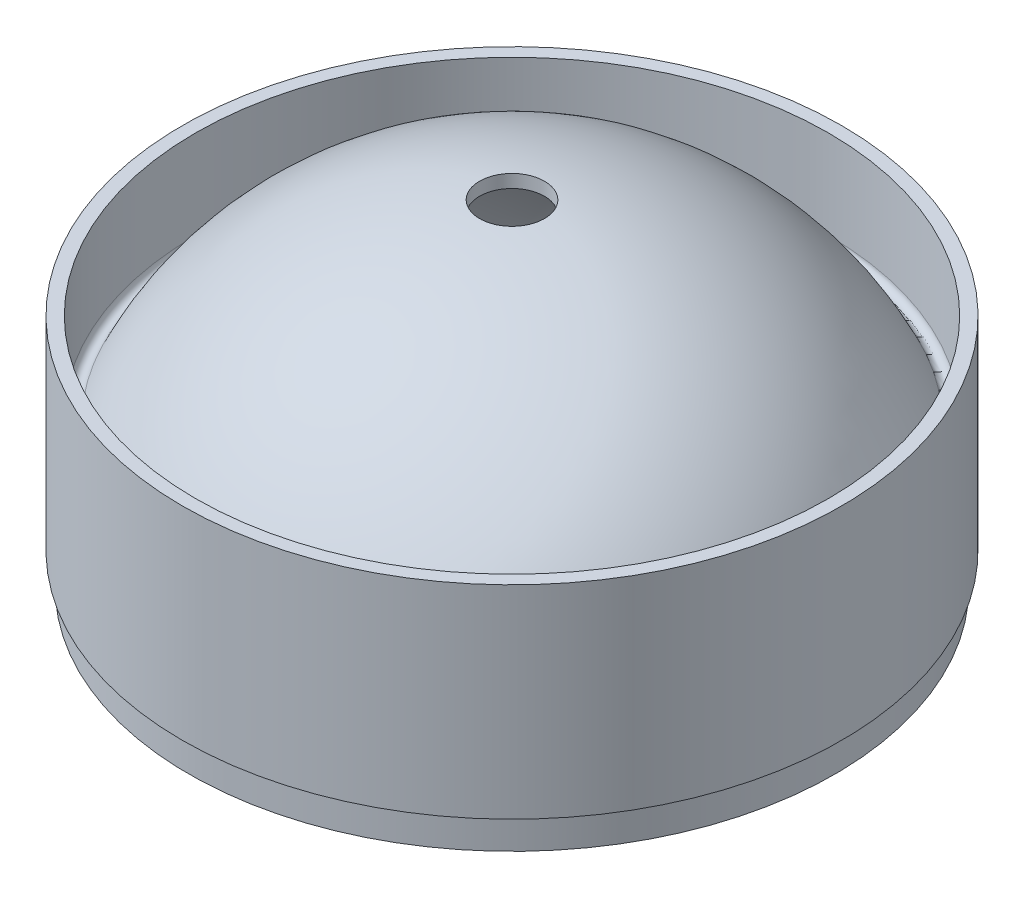
ISO-10303-21;
HEADER;
FILE_DESCRIPTION(('STEP AP214'),'2;1');
FILE_NAME('part.step','',(''),(''),'','','');
FILE_SCHEMA(('AUTOMOTIVE_DESIGN { 1 0 10303 214 1 1 1 1 }'));
ENDSEC;
DATA;
#1=APPLICATION_CONTEXT('core data for automotive mechanical design processes');
#2=APPLICATION_PROTOCOL_DEFINITION('international standard','automotive_design',2000,#1);
#3=PRODUCT_CONTEXT('',#1,'mechanical');
#4=PRODUCT('Part','Part','',(#3));
#5=PRODUCT_RELATED_PRODUCT_CATEGORY('part','',(#4));
#6=PRODUCT_DEFINITION_FORMATION('','',#4);
#7=PRODUCT_DEFINITION_CONTEXT('part definition',#1,'design');
#8=PRODUCT_DEFINITION('design','',#6,#7);
#9=PRODUCT_DEFINITION_SHAPE('','',#8);
#10=(LENGTH_UNIT() NAMED_UNIT(*) SI_UNIT(.MILLI.,.METRE.));
#11=(NAMED_UNIT(*) PLANE_ANGLE_UNIT() SI_UNIT($,.RADIAN.));
#12=(NAMED_UNIT(*) SI_UNIT($,.STERADIAN.) SOLID_ANGLE_UNIT());
#13=UNCERTAINTY_MEASURE_WITH_UNIT(LENGTH_MEASURE(1.E-05),#10,'distance_accuracy_value','');
#14=(GEOMETRIC_REPRESENTATION_CONTEXT(3) GLOBAL_UNCERTAINTY_ASSIGNED_CONTEXT((#13)) GLOBAL_UNIT_ASSIGNED_CONTEXT((#10,
#11,#12)) REPRESENTATION_CONTEXT('',''));
#15=CARTESIAN_POINT('',(0.,0.,0.));
#16=DIRECTION('',(0.,0.,1.));
#17=DIRECTION('',(1.,0.,0.));
#18=AXIS2_PLACEMENT_3D('',#15,#16,#17);
#19=CARTESIAN_POINT('',(0.,875.58,0.));
#20=DIRECTION('',(0.,-1.,0.));
#21=DIRECTION('',(1.,0.,0.));
#22=AXIS2_PLACEMENT_3D('',#19,#20,#21);
#23=SPHERICAL_SURFACE('',#22,124.42);
#24=CARTESIAN_POINT('',(0.,999.370493980758,0.));
#25=DIRECTION('',(0.,-1.,0.));
#26=DIRECTION('',(0.,0.,-1.));
#27=AXIS2_PLACEMENT_3D('',#24,#25,#26);
#28=CIRCLE('',#27,12.5);
#29=CARTESIAN_POINT('',(0.,999.370493980758,-12.5));
#30=VERTEX_POINT('',#29);
#31=EDGE_CURVE('E70',#30,#30,#28,.T.);
#32=ORIENTED_EDGE('',*,*,#31,.F.);
#33=EDGE_LOOP('',(#32));
#34=FACE_BOUND('',#33,.T.);
#35=CARTESIAN_POINT('',(0.,900.,0.));
#36=DIRECTION('',(0.,-1.,0.));
#37=DIRECTION('',(0.,0.,-1.));
#38=AXIS2_PLACEMENT_3D('',#35,#36,#37);
#39=CIRCLE('',#38,122.);
#40=CARTESIAN_POINT('',(0.,900.,-122.));
#41=VERTEX_POINT('',#40);
#42=EDGE_CURVE('E67',#41,#41,#39,.T.);
#43=ORIENTED_EDGE('',*,*,#42,.T.);
#44=EDGE_LOOP('',(#43));
#45=FACE_BOUND('',#44,.T.);
#46=ADVANCED_FACE('F36',(#34,#45),#23,.F.);
#47=CARTESIAN_POINT('',(0.,875.58,0.));
#48=DIRECTION('',(0.,-1.,0.));
#49=DIRECTION('',(1.,0.,0.));
#50=AXIS2_PLACEMENT_3D('',#47,#48,#49);
#51=SPHERICAL_SURFACE('',#50,129.42);
#52=CARTESIAN_POINT('',(0.,1004.39493081161,0.));
#53=DIRECTION('',(0.,-1.,0.));
#54=DIRECTION('',(0.,0.,-1.));
#55=AXIS2_PLACEMENT_3D('',#52,#53,#54);
#56=CIRCLE('',#55,12.5);
#57=CARTESIAN_POINT('',(0.,1004.39493081161,-12.5));
#58=VERTEX_POINT('',#57);
#59=EDGE_CURVE('E39',#58,#58,#56,.F.);
#60=ORIENTED_EDGE('',*,*,#59,.F.);
#61=EDGE_LOOP('',(#60));
#62=FACE_BOUND('',#61,.T.);
#63=CARTESIAN_POINT('',(0.,930.401569107859,0.));
#64=DIRECTION('',(0.,-1.,0.));
#65=DIRECTION('',(0.,0.,-1.));
#66=AXIS2_PLACEMENT_3D('',#63,#64,#65);
#67=CIRCLE('',#66,117.235369921164);
#68=CARTESIAN_POINT('',(0.,930.401569107859,-117.235369921164));
#69=VERTEX_POINT('',#68);
#70=EDGE_CURVE('E10',#69,#69,#67,.T.);
#71=ORIENTED_EDGE('',*,*,#70,.F.);
#72=EDGE_LOOP('',(#71));
#73=FACE_BOUND('',#72,.T.);
#74=ADVANCED_FACE('F79',(#62,#73),#51,.T.);
#75=CARTESIAN_POINT('',(0.,931.460554757447,0.));
#76=DIRECTION('',(0.,-1.,0.));
#77=DIRECTION('',(0.,0.,-1.));
#78=AXIS2_PLACEMENT_3D('',#75,#76,#77);
#79=TOROIDAL_SURFACE('',#78,119.5,2.5);
#80=ORIENTED_EDGE('',*,*,#70,.T.);
#81=EDGE_LOOP('',(#80));
#82=FACE_BOUND('',#81,.T.);
#83=CARTESIAN_POINT('',(0.,931.460554757447,0.));
#84=DIRECTION('',(0.,-1.,0.));
#85=DIRECTION('',(0.,0.,-1.));
#86=AXIS2_PLACEMENT_3D('',#83,#84,#85);
#87=CIRCLE('',#86,122.);
#88=CARTESIAN_POINT('',(0.,931.460554757447,-122.));
#89=VERTEX_POINT('',#88);
#90=EDGE_CURVE('E43',#89,#89,#87,.T.);
#91=ORIENTED_EDGE('',*,*,#90,.F.);
#92=EDGE_LOOP('',(#91));
#93=FACE_BOUND('',#92,.T.);
#94=ADVANCED_FACE('F82',(#82,#93),#79,.F.);
#95=CARTESIAN_POINT('',(0.,0.,0.));
#96=DIRECTION('',(0.,-1.,0.));
#97=DIRECTION('',(0.,0.,-1.));
#98=AXIS2_PLACEMENT_3D('',#95,#96,#97);
#99=CYLINDRICAL_SURFACE('',#98,122.);
#100=ORIENTED_EDGE('',*,*,#90,.T.);
#101=EDGE_LOOP('',(#100));
#102=FACE_BOUND('',#101,.T.);
#103=CARTESIAN_POINT('',(0.,965.730277378723,0.));
#104=DIRECTION('',(0.,-1.,0.));
#105=DIRECTION('',(0.,0.,-1.));
#106=AXIS2_PLACEMENT_3D('',#103,#104,#105);
#107=CIRCLE('',#106,122.);
#108=CARTESIAN_POINT('',(0.,965.730277378723,-122.));
#109=VERTEX_POINT('',#108);
#110=EDGE_CURVE('E47',#109,#109,#107,.T.);
#111=ORIENTED_EDGE('',*,*,#110,.F.);
#112=EDGE_LOOP('',(#111));
#113=FACE_BOUND('',#112,.T.);
#114=ADVANCED_FACE('F87',(#102,#113),#99,.F.);
#115=CARTESIAN_POINT('',(122.,965.730277378723,0.));
#116=DIRECTION('',(0.,1.,0.));
#117=DIRECTION('',(0.,0.,1.));
#118=AXIS2_PLACEMENT_3D('',#115,#116,#117);
#119=PLANE('',#118);
#120=ORIENTED_EDGE('',*,*,#110,.T.);
#121=EDGE_LOOP('',(#120));
#122=FACE_BOUND('',#121,.T.);
#123=CARTESIAN_POINT('',(0.,965.730277378723,0.));
#124=DIRECTION('',(0.,-1.,0.));
#125=DIRECTION('',(0.,0.,-1.));
#126=AXIS2_PLACEMENT_3D('',#123,#124,#125);
#127=CIRCLE('',#126,127.);
#128=CARTESIAN_POINT('',(0.,965.730277378723,-127.));
#129=VERTEX_POINT('',#128);
#130=EDGE_CURVE('E52',#129,#129,#127,.T.);
#131=ORIENTED_EDGE('',*,*,#130,.F.);
#132=EDGE_LOOP('',(#131));
#133=FACE_BOUND('',#132,.T.);
#134=ADVANCED_FACE('F93',(#122,#133),#119,.T.);
#135=CARTESIAN_POINT('',(0.,0.,0.));
#136=DIRECTION('',(0.,-1.,0.));
#137=DIRECTION('',(0.,0.,-1.));
#138=AXIS2_PLACEMENT_3D('',#135,#136,#137);
#139=CYLINDRICAL_SURFACE('',#138,127.);
#140=ORIENTED_EDGE('',*,*,#130,.T.);
#141=EDGE_LOOP('',(#140));
#142=FACE_BOUND('',#141,.T.);
#143=CARTESIAN_POINT('',(0.,887.5,0.));
#144=DIRECTION('',(0.,-1.,0.));
#145=DIRECTION('',(0.,0.,-1.));
#146=AXIS2_PLACEMENT_3D('',#143,#144,#145);
#147=CIRCLE('',#146,127.);
#148=CARTESIAN_POINT('',(0.,887.5,-127.));
#149=VERTEX_POINT('',#148);
#150=EDGE_CURVE('E55',#149,#149,#147,.T.);
#151=ORIENTED_EDGE('',*,*,#150,.F.);
#152=EDGE_LOOP('',(#151));
#153=FACE_BOUND('',#152,.T.);
#154=ADVANCED_FACE('F97',(#142,#153),#139,.T.);
#155=CARTESIAN_POINT('',(127.,887.5,0.));
#156=DIRECTION('',(0.,-1.,0.));
#157=DIRECTION('',(0.,0.,-1.));
#158=AXIS2_PLACEMENT_3D('',#155,#156,#157);
#159=PLANE('',#158);
#160=ORIENTED_EDGE('',*,*,#150,.T.);
#161=EDGE_LOOP('',(#160));
#162=FACE_BOUND('',#161,.T.);
#163=CARTESIAN_POINT('',(0.,887.5,0.));
#164=DIRECTION('',(0.,-1.,0.));
#165=DIRECTION('',(0.,0.,-1.));
#166=AXIS2_PLACEMENT_3D('',#163,#164,#165);
#167=CIRCLE('',#166,124.5);
#168=CARTESIAN_POINT('',(0.,887.5,-124.5));
#169=VERTEX_POINT('',#168);
#170=EDGE_CURVE('E58',#169,#169,#167,.T.);
#171=ORIENTED_EDGE('',*,*,#170,.F.);
#172=EDGE_LOOP('',(#171));
#173=FACE_BOUND('',#172,.T.);
#174=ADVANCED_FACE('F101',(#162,#173),#159,.T.);
#175=CARTESIAN_POINT('',(0.,0.,0.));
#176=DIRECTION('',(0.,-1.,0.));
#177=DIRECTION('',(0.,0.,-1.));
#178=AXIS2_PLACEMENT_3D('',#175,#176,#177);
#179=CYLINDRICAL_SURFACE('',#178,124.5);
#180=ORIENTED_EDGE('',*,*,#170,.T.);
#181=EDGE_LOOP('',(#180));
#182=FACE_BOUND('',#181,.T.);
#183=CARTESIAN_POINT('',(0.,875.,0.));
#184=DIRECTION('',(0.,-1.,0.));
#185=DIRECTION('',(0.,0.,-1.));
#186=AXIS2_PLACEMENT_3D('',#183,#184,#185);
#187=CIRCLE('',#186,124.5);
#188=CARTESIAN_POINT('',(0.,875.,-124.5));
#189=VERTEX_POINT('',#188);
#190=EDGE_CURVE('E61',#189,#189,#187,.T.);
#191=ORIENTED_EDGE('',*,*,#190,.F.);
#192=EDGE_LOOP('',(#191));
#193=FACE_BOUND('',#192,.T.);
#194=ADVANCED_FACE('F105',(#182,#193),#179,.T.);
#195=CARTESIAN_POINT('',(122.,875.,0.));
#196=DIRECTION('',(0.,-1.,0.));
#197=DIRECTION('',(0.,0.,-1.));
#198=AXIS2_PLACEMENT_3D('',#195,#196,#197);
#199=PLANE('',#198);
#200=ORIENTED_EDGE('',*,*,#190,.T.);
#201=EDGE_LOOP('',(#200));
#202=FACE_BOUND('',#201,.T.);
#203=CARTESIAN_POINT('',(0.,875.,0.));
#204=DIRECTION('',(0.,-1.,0.));
#205=DIRECTION('',(0.,0.,-1.));
#206=AXIS2_PLACEMENT_3D('',#203,#204,#205);
#207=CIRCLE('',#206,122.);
#208=CARTESIAN_POINT('',(0.,875.,-122.));
#209=VERTEX_POINT('',#208);
#210=EDGE_CURVE('E64',#209,#209,#207,.T.);
#211=ORIENTED_EDGE('',*,*,#210,.F.);
#212=EDGE_LOOP('',(#211));
#213=FACE_BOUND('',#212,.T.);
#214=ADVANCED_FACE('F109',(#202,#213),#199,.T.);
#215=CARTESIAN_POINT('',(0.,0.,0.));
#216=DIRECTION('',(0.,-1.,0.));
#217=DIRECTION('',(0.,0.,-1.));
#218=AXIS2_PLACEMENT_3D('',#215,#216,#217);
#219=CYLINDRICAL_SURFACE('',#218,122.);
#220=ORIENTED_EDGE('',*,*,#210,.T.);
#221=EDGE_LOOP('',(#220));
#222=FACE_BOUND('',#221,.T.);
#223=ORIENTED_EDGE('',*,*,#42,.F.);
#224=EDGE_LOOP('',(#223));
#225=FACE_BOUND('',#224,.T.);
#226=ADVANCED_FACE('F113',(#222,#225),#219,.F.);
#227=CARTESIAN_POINT('',(0.,1875.,0.));
#228=DIRECTION('',(0.,-1.,0.));
#229=DIRECTION('',(0.,0.,-1.));
#230=AXIS2_PLACEMENT_3D('',#227,#228,#229);
#231=CYLINDRICAL_SURFACE('',#230,12.5);
#232=ORIENTED_EDGE('',*,*,#31,.T.);
#233=EDGE_LOOP('',(#232));
#234=FACE_BOUND('',#233,.T.);
#235=ORIENTED_EDGE('',*,*,#59,.T.);
#236=EDGE_LOOP('',(#235));
#237=FACE_BOUND('',#236,.T.);
#238=ADVANCED_FACE('F77',(#234,#237),#231,.F.);
#239=CLOSED_SHELL('',(#46,#74,#94,#114,#134,#154,#174,#194,#214,#226,#238));
#240=MANIFOLD_SOLID_BREP('B2',#239);
#241=ADVANCED_BREP_SHAPE_REPRESENTATION('',(#18,#240),#14);
#242=SHAPE_DEFINITION_REPRESENTATION(#9,#241);
ENDSEC;
END-ISO-10303-21;
